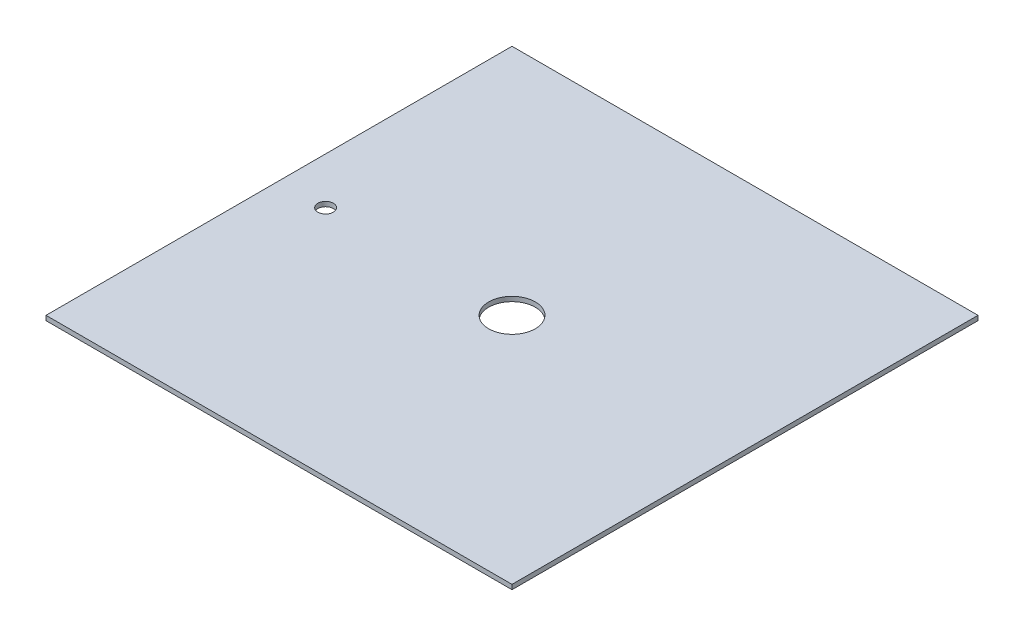
ISO-10303-21;
HEADER;
FILE_DESCRIPTION(('STEP AP214'),'2;1');
FILE_NAME('part.step','',(''),(''),'','','');
FILE_SCHEMA(('AUTOMOTIVE_DESIGN { 1 0 10303 214 1 1 1 1 }'));
ENDSEC;
DATA;
#1=APPLICATION_CONTEXT('core data for automotive mechanical design processes');
#2=APPLICATION_PROTOCOL_DEFINITION('international standard','automotive_design',2000,#1);
#3=PRODUCT_CONTEXT('',#1,'mechanical');
#4=PRODUCT('Part','Part','',(#3));
#5=PRODUCT_RELATED_PRODUCT_CATEGORY('part','',(#4));
#6=PRODUCT_DEFINITION_FORMATION('','',#4);
#7=PRODUCT_DEFINITION_CONTEXT('part definition',#1,'design');
#8=PRODUCT_DEFINITION('design','',#6,#7);
#9=PRODUCT_DEFINITION_SHAPE('','',#8);
#10=(LENGTH_UNIT() NAMED_UNIT(*) SI_UNIT(.MILLI.,.METRE.));
#11=(NAMED_UNIT(*) PLANE_ANGLE_UNIT() SI_UNIT($,.RADIAN.));
#12=(NAMED_UNIT(*) SI_UNIT($,.STERADIAN.) SOLID_ANGLE_UNIT());
#13=UNCERTAINTY_MEASURE_WITH_UNIT(LENGTH_MEASURE(1.E-05),#10,'distance_accuracy_value','');
#14=(GEOMETRIC_REPRESENTATION_CONTEXT(3) GLOBAL_UNCERTAINTY_ASSIGNED_CONTEXT((#13)) GLOBAL_UNIT_ASSIGNED_CONTEXT((#10,
#11,#12)) REPRESENTATION_CONTEXT('',''));
#15=CARTESIAN_POINT('',(0.,0.,0.));
#16=DIRECTION('',(0.,0.,1.));
#17=DIRECTION('',(1.,0.,0.));
#18=AXIS2_PLACEMENT_3D('',#15,#16,#17);
#19=CARTESIAN_POINT('',(150.,3.,-150.));
#20=DIRECTION('',(-1.,0.,0.));
#21=DIRECTION('',(0.,0.,1.));
#22=AXIS2_PLACEMENT_3D('',#19,#20,#21);
#23=PLANE('',#22);
#24=DIRECTION('',(0.,0.,-1.));
#25=VECTOR('',#24,1.);
#26=CARTESIAN_POINT('',(150.,0.,-150.));
#27=LINE('',#26,#25);
#28=CARTESIAN_POINT('',(150.,0.,150.));
#29=VERTEX_POINT('',#28);
#30=CARTESIAN_POINT('',(150.,0.,-150.));
#31=VERTEX_POINT('',#30);
#32=EDGE_CURVE('E113',#29,#31,#27,.T.);
#33=ORIENTED_EDGE('',*,*,#32,.T.);
#34=DIRECTION('',(0.,-1.,0.));
#35=VECTOR('',#34,1.);
#36=CARTESIAN_POINT('',(150.,3.,-150.));
#37=LINE('',#36,#35);
#38=CARTESIAN_POINT('',(150.,3.,-150.));
#39=VERTEX_POINT('',#38);
#40=EDGE_CURVE('E11',#39,#31,#37,.T.);
#41=ORIENTED_EDGE('',*,*,#40,.F.);
#42=DIRECTION('',(0.,0.,-1.));
#43=VECTOR('',#42,1.);
#44=CARTESIAN_POINT('',(150.,3.,-150.));
#45=LINE('',#44,#43);
#46=CARTESIAN_POINT('',(150.,3.,150.));
#47=VERTEX_POINT('',#46);
#48=EDGE_CURVE('E97',#47,#39,#45,.T.);
#49=ORIENTED_EDGE('',*,*,#48,.F.);
#50=DIRECTION('',(0.,-1.,0.));
#51=VECTOR('',#50,1.);
#52=CARTESIAN_POINT('',(150.,3.,150.));
#53=LINE('',#52,#51);
#54=EDGE_CURVE('E109',#47,#29,#53,.T.);
#55=ORIENTED_EDGE('',*,*,#54,.T.);
#56=EDGE_LOOP('',(#33,#41,#49,#55));
#57=FACE_BOUND('',#56,.T.);
#58=ADVANCED_FACE('F45',(#57),#23,.F.);
#59=CARTESIAN_POINT('',(-150.,3.,-150.));
#60=DIRECTION('',(0.,0.,1.));
#61=DIRECTION('',(1.,0.,0.));
#62=AXIS2_PLACEMENT_3D('',#59,#60,#61);
#63=PLANE('',#62);
#64=DIRECTION('',(-1.,0.,0.));
#65=VECTOR('',#64,1.);
#66=CARTESIAN_POINT('',(-150.,0.,-150.));
#67=LINE('',#66,#65);
#68=CARTESIAN_POINT('',(-150.,0.,-150.));
#69=VERTEX_POINT('',#68);
#70=EDGE_CURVE('E102',#31,#69,#67,.T.);
#71=ORIENTED_EDGE('',*,*,#70,.T.);
#72=DIRECTION('',(0.,-1.,0.));
#73=VECTOR('',#72,1.);
#74=CARTESIAN_POINT('',(-150.,3.,-150.));
#75=LINE('',#74,#73);
#76=CARTESIAN_POINT('',(-150.,3.,-150.));
#77=VERTEX_POINT('',#76);
#78=EDGE_CURVE('E54',#77,#69,#75,.T.);
#79=ORIENTED_EDGE('',*,*,#78,.F.);
#80=DIRECTION('',(-1.,0.,0.));
#81=VECTOR('',#80,1.);
#82=CARTESIAN_POINT('',(-150.,3.,-150.));
#83=LINE('',#82,#81);
#84=EDGE_CURVE('E92',#39,#77,#83,.T.);
#85=ORIENTED_EDGE('',*,*,#84,.F.);
#86=ORIENTED_EDGE('',*,*,#40,.T.);
#87=EDGE_LOOP('',(#71,#79,#85,#86));
#88=FACE_BOUND('',#87,.T.);
#89=ADVANCED_FACE('F101',(#88),#63,.F.);
#90=CARTESIAN_POINT('',(-150.,3.,-150.));
#91=DIRECTION('',(1.,0.,0.));
#92=DIRECTION('',(0.,0.,-1.));
#93=AXIS2_PLACEMENT_3D('',#90,#91,#92);
#94=PLANE('',#93);
#95=DIRECTION('',(0.,0.,1.));
#96=VECTOR('',#95,1.);
#97=CARTESIAN_POINT('',(-150.,0.,-150.));
#98=LINE('',#97,#96);
#99=CARTESIAN_POINT('',(-150.,0.,150.));
#100=VERTEX_POINT('',#99);
#101=EDGE_CURVE('E79',#69,#100,#98,.T.);
#102=ORIENTED_EDGE('',*,*,#101,.T.);
#103=DIRECTION('',(0.,-1.,0.));
#104=VECTOR('',#103,1.);
#105=CARTESIAN_POINT('',(-150.,3.,150.));
#106=LINE('',#105,#104);
#107=CARTESIAN_POINT('',(-150.,3.,150.));
#108=VERTEX_POINT('',#107);
#109=EDGE_CURVE('E104',#108,#100,#106,.T.);
#110=ORIENTED_EDGE('',*,*,#109,.F.);
#111=DIRECTION('',(0.,0.,1.));
#112=VECTOR('',#111,1.);
#113=CARTESIAN_POINT('',(-150.,3.,-150.));
#114=LINE('',#113,#112);
#115=EDGE_CURVE('E95',#77,#108,#114,.T.);
#116=ORIENTED_EDGE('',*,*,#115,.F.);
#117=ORIENTED_EDGE('',*,*,#78,.T.);
#118=EDGE_LOOP('',(#102,#110,#116,#117));
#119=FACE_BOUND('',#118,.T.);
#120=ADVANCED_FACE('F105',(#119),#94,.F.);
#121=CARTESIAN_POINT('',(-150.,3.,150.));
#122=DIRECTION('',(0.,0.,-1.));
#123=DIRECTION('',(-1.,0.,0.));
#124=AXIS2_PLACEMENT_3D('',#121,#122,#123);
#125=PLANE('',#124);
#126=DIRECTION('',(1.,0.,0.));
#127=VECTOR('',#126,1.);
#128=CARTESIAN_POINT('',(-150.,0.,150.));
#129=LINE('',#128,#127);
#130=EDGE_CURVE('E85',#100,#29,#129,.T.);
#131=ORIENTED_EDGE('',*,*,#130,.T.);
#132=ORIENTED_EDGE('',*,*,#54,.F.);
#133=DIRECTION('',(1.,0.,0.));
#134=VECTOR('',#133,1.);
#135=CARTESIAN_POINT('',(-150.,3.,150.));
#136=LINE('',#135,#134);
#137=EDGE_CURVE('E62',#108,#47,#136,.T.);
#138=ORIENTED_EDGE('',*,*,#137,.F.);
#139=ORIENTED_EDGE('',*,*,#109,.T.);
#140=EDGE_LOOP('',(#131,#132,#138,#139));
#141=FACE_BOUND('',#140,.T.);
#142=ADVANCED_FACE('F127',(#141),#125,.F.);
#143=CARTESIAN_POINT('',(0.,3.,0.));
#144=DIRECTION('',(0.,1.,0.));
#145=DIRECTION('',(0.,0.,1.));
#146=AXIS2_PLACEMENT_3D('',#143,#144,#145);
#147=PLANE('',#146);
#148=CARTESIAN_POINT('',(-120.,3.,0.));
#149=DIRECTION('',(0.,1.,0.));
#150=DIRECTION('',(0.,0.,1.));
#151=AXIS2_PLACEMENT_3D('',#148,#149,#150);
#152=CIRCLE('',#151,5.);
#153=CARTESIAN_POINT('',(-120.,3.,5.));
#154=VERTEX_POINT('',#153);
#155=EDGE_CURVE('E142',#154,#154,#152,.T.);
#156=ORIENTED_EDGE('',*,*,#155,.F.);
#157=EDGE_LOOP('',(#156));
#158=FACE_BOUND('',#157,.T.);
#159=CARTESIAN_POINT('',(0.,3.,0.));
#160=DIRECTION('',(0.,1.,0.));
#161=DIRECTION('',(0.,0.,1.));
#162=AXIS2_PLACEMENT_3D('',#159,#160,#161);
#163=CIRCLE('',#162,15.);
#164=CARTESIAN_POINT('',(0.,3.,15.));
#165=VERTEX_POINT('',#164);
#166=EDGE_CURVE('E134',#165,#165,#163,.T.);
#167=ORIENTED_EDGE('',*,*,#166,.F.);
#168=EDGE_LOOP('',(#167));
#169=FACE_BOUND('',#168,.T.);
#170=ORIENTED_EDGE('',*,*,#48,.T.);
#171=ORIENTED_EDGE('',*,*,#84,.T.);
#172=ORIENTED_EDGE('',*,*,#115,.T.);
#173=ORIENTED_EDGE('',*,*,#137,.T.);
#174=EDGE_LOOP('',(#170,#171,#172,#173));
#175=FACE_BOUND('',#174,.T.);
#176=ADVANCED_FACE('F93',(#158,#169,#175),#147,.T.);
#177=CARTESIAN_POINT('',(0.,0.,0.));
#178=DIRECTION('',(0.,1.,0.));
#179=DIRECTION('',(0.,0.,1.));
#180=AXIS2_PLACEMENT_3D('',#177,#178,#179);
#181=PLANE('',#180);
#182=CARTESIAN_POINT('',(-120.,0.,0.));
#183=DIRECTION('',(0.,1.,0.));
#184=DIRECTION('',(0.,0.,1.));
#185=AXIS2_PLACEMENT_3D('',#182,#183,#184);
#186=CIRCLE('',#185,5.);
#187=CARTESIAN_POINT('',(-120.,0.,5.));
#188=VERTEX_POINT('',#187);
#189=EDGE_CURVE('E138',#188,#188,#186,.T.);
#190=ORIENTED_EDGE('',*,*,#189,.T.);
#191=EDGE_LOOP('',(#190));
#192=FACE_BOUND('',#191,.T.);
#193=CARTESIAN_POINT('',(0.,0.,0.));
#194=DIRECTION('',(0.,1.,0.));
#195=DIRECTION('',(0.,0.,1.));
#196=AXIS2_PLACEMENT_3D('',#193,#194,#195);
#197=CIRCLE('',#196,15.);
#198=CARTESIAN_POINT('',(0.,0.,15.));
#199=VERTEX_POINT('',#198);
#200=EDGE_CURVE('E117',#199,#199,#197,.T.);
#201=ORIENTED_EDGE('',*,*,#200,.T.);
#202=EDGE_LOOP('',(#201));
#203=FACE_BOUND('',#202,.T.);
#204=ORIENTED_EDGE('',*,*,#32,.F.);
#205=ORIENTED_EDGE('',*,*,#130,.F.);
#206=ORIENTED_EDGE('',*,*,#101,.F.);
#207=ORIENTED_EDGE('',*,*,#70,.F.);
#208=EDGE_LOOP('',(#204,#205,#206,#207));
#209=FACE_BOUND('',#208,.T.);
#210=ADVANCED_FACE('F130',(#192,#203,#209),#181,.F.);
#211=CARTESIAN_POINT('',(0.,0.,0.));
#212=DIRECTION('',(0.,1.,0.));
#213=DIRECTION('',(0.,0.,1.));
#214=AXIS2_PLACEMENT_3D('',#211,#212,#213);
#215=CYLINDRICAL_SURFACE('',#214,15.);
#216=ORIENTED_EDGE('',*,*,#200,.F.);
#217=EDGE_LOOP('',(#216));
#218=FACE_BOUND('',#217,.T.);
#219=ORIENTED_EDGE('',*,*,#166,.T.);
#220=EDGE_LOOP('',(#219));
#221=FACE_BOUND('',#220,.T.);
#222=ADVANCED_FACE('F155',(#218,#221),#215,.F.);
#223=CARTESIAN_POINT('',(-120.,0.,0.));
#224=DIRECTION('',(0.,1.,0.));
#225=DIRECTION('',(0.,0.,1.));
#226=AXIS2_PLACEMENT_3D('',#223,#224,#225);
#227=CYLINDRICAL_SURFACE('',#226,5.);
#228=ORIENTED_EDGE('',*,*,#189,.F.);
#229=EDGE_LOOP('',(#228));
#230=FACE_BOUND('',#229,.T.);
#231=ORIENTED_EDGE('',*,*,#155,.T.);
#232=EDGE_LOOP('',(#231));
#233=FACE_BOUND('',#232,.T.);
#234=ADVANCED_FACE('F152',(#230,#233),#227,.F.);
#235=CLOSED_SHELL('',(#58,#89,#120,#142,#176,#210,#222,#234));
#236=MANIFOLD_SOLID_BREP('B2',#235);
#237=ADVANCED_BREP_SHAPE_REPRESENTATION('',(#18,#236),#14);
#238=SHAPE_DEFINITION_REPRESENTATION(#9,#237);
ENDSEC;
END-ISO-10303-21;
